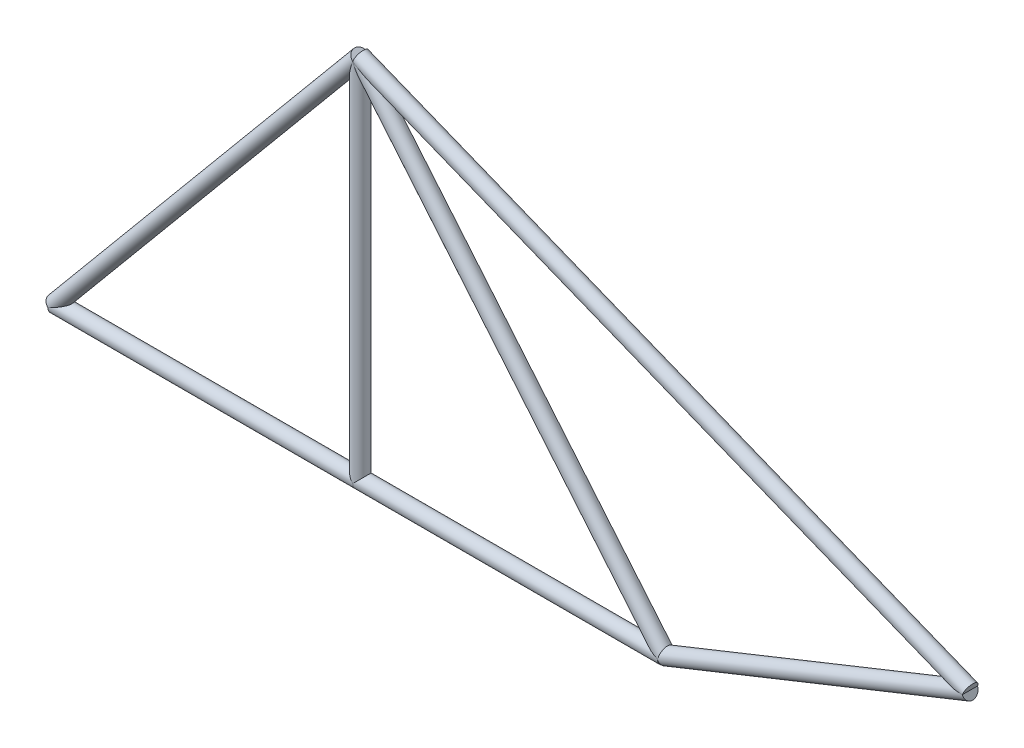
ISO-10303-21;
HEADER;
FILE_DESCRIPTION(('STEP AP214'),'2;1');
FILE_NAME('part.step','',(''),(''),'','','');
FILE_SCHEMA(('AUTOMOTIVE_DESIGN { 1 0 10303 214 1 1 1 1 }'));
ENDSEC;
DATA;
#1=APPLICATION_CONTEXT('core data for automotive mechanical design processes');
#2=APPLICATION_PROTOCOL_DEFINITION('international standard','automotive_design',2000,#1);
#3=PRODUCT_CONTEXT('',#1,'mechanical');
#4=PRODUCT('Part','Part','',(#3));
#5=PRODUCT_RELATED_PRODUCT_CATEGORY('part','',(#4));
#6=PRODUCT_DEFINITION_FORMATION('','',#4);
#7=PRODUCT_DEFINITION_CONTEXT('part definition',#1,'design');
#8=PRODUCT_DEFINITION('design','',#6,#7);
#9=PRODUCT_DEFINITION_SHAPE('','',#8);
#10=(LENGTH_UNIT() NAMED_UNIT(*) SI_UNIT(.MILLI.,.METRE.));
#11=(NAMED_UNIT(*) PLANE_ANGLE_UNIT() SI_UNIT($,.RADIAN.));
#12=(NAMED_UNIT(*) SI_UNIT($,.STERADIAN.) SOLID_ANGLE_UNIT());
#13=UNCERTAINTY_MEASURE_WITH_UNIT(LENGTH_MEASURE(1.E-05),#10,'distance_accuracy_value','');
#14=(GEOMETRIC_REPRESENTATION_CONTEXT(3) GLOBAL_UNCERTAINTY_ASSIGNED_CONTEXT((#13)) GLOBAL_UNIT_ASSIGNED_CONTEXT((#10,
#11,#12)) REPRESENTATION_CONTEXT('',''));
#15=CARTESIAN_POINT('',(0.,0.,0.));
#16=DIRECTION('',(0.,0.,1.));
#17=DIRECTION('',(1.,0.,0.));
#18=AXIS2_PLACEMENT_3D('',#15,#16,#17);
#19=CARTESIAN_POINT('',(5080.,0.,0.));
#20=DIRECTION('',(0.928476690885259,0.371390676354104,0.));
#21=DIRECTION('',(-0.371390676354104,0.928476690885259,0.));
#22=AXIS2_PLACEMENT_3D('',#19,#20,#21);
#23=CYLINDRICAL_SURFACE('',#22,63.5);
#24=CARTESIAN_POINT('',(5080.,0.,0.));
#25=DIRECTION('',(0.969460291496286,-0.245248329682256,0.));
#26=DIRECTION('',(-0.245248329682256,-0.969460291496286,0.));
#27=AXIS2_PLACEMENT_3D('',#24,#25,#26);
#28=ELLIPSE('',#27,78.4882456521442,63.5);
#29=CARTESIAN_POINT('',(5080.,0.,-63.5));
#30=VERTEX_POINT('',#29);
#31=CARTESIAN_POINT('',(5080.,-4.44089209850063E-13,63.5));
#32=VERTEX_POINT('',#31);
#33=EDGE_CURVE('E85',#30,#32,#28,.T.);
#34=ORIENTED_EDGE('',*,*,#33,.T.);
#35=CARTESIAN_POINT('',(5080.,0.,0.));
#36=DIRECTION('',(0.981956386731422,0.189107521154951,0.));
#37=DIRECTION('',(0.189107521154951,-0.981956386731422,0.));
#38=AXIS2_PLACEMENT_3D('',#35,#36,#37);
#39=ELLIPSE('',#38,64.6668231481936,63.5);
#40=EDGE_CURVE('E76',#30,#32,#39,.T.);
#41=ORIENTED_EDGE('',*,*,#40,.F.);
#42=EDGE_LOOP('',(#34,#41));
#43=FACE_BOUND('',#42,.T.);
#44=ADVANCED_FACE('F56',(#43),#23,.F.);
#45=CARTESIAN_POINT('',(2540.,0.,0.));
#46=DIRECTION('',(1.,0.,0.));
#47=DIRECTION('',(0.,0.,-1.));
#48=AXIS2_PLACEMENT_3D('',#45,#46,#47);
#49=CYLINDRICAL_SURFACE('',#48,63.5);
#50=CARTESIAN_POINT('',(5080.,-2.22044604925031E-13,0.));
#51=DIRECTION('',(-0.424155396249723,-0.90558942122368,0.));
#52=DIRECTION('',(0.90558942122368,-0.424155396249724,0.));
#53=AXIS2_PLACEMENT_3D('',#50,#51,#52);
#54=ELLIPSE('',#53,149.709282403221,63.5);
#55=EDGE_CURVE('E88',#32,#30,#54,.T.);
#56=ORIENTED_EDGE('',*,*,#55,.T.);
#57=ORIENTED_EDGE('',*,*,#40,.T.);
#58=EDGE_LOOP('',(#56,#57));
#59=FACE_BOUND('',#58,.T.);
#60=ADVANCED_FACE('F58',(#59),#49,.F.);
#61=CARTESIAN_POINT('',(2540.,3048.,0.));
#62=DIRECTION('',(0.64018439966448,-0.768221279597376,0.));
#63=DIRECTION('',(0.768221279597376,0.64018439966448,0.));
#64=AXIS2_PLACEMENT_3D('',#61,#62,#63);
#65=CYLINDRICAL_SURFACE('',#64,63.5);
#66=ORIENTED_EDGE('',*,*,#55,.F.);
#67=ORIENTED_EDGE('',*,*,#33,.F.);
#68=EDGE_LOOP('',(#66,#67));
#69=FACE_BOUND('',#68,.T.);
#70=CARTESIAN_POINT('',(2539.99999999999,3048.,0.));
#71=DIRECTION('',(-0.58775587094577,-0.809038340357723,0.));
#72=DIRECTION('',(0.809038340357723,-0.58775587094577,0.));
#73=AXIS2_PLACEMENT_3D('',#70,#71,#72);
#74=ELLIPSE('',#73,258.921233356699,63.5);
#75=CARTESIAN_POINT('',(2540.,3048.,63.5));
#76=VERTEX_POINT('',#75);
#77=CARTESIAN_POINT('',(2540.,3048.,-63.5));
#78=VERTEX_POINT('',#77);
#79=EDGE_CURVE('E13',#76,#78,#74,.F.);
#80=ORIENTED_EDGE('',*,*,#79,.F.);
#81=CARTESIAN_POINT('',(2540.,3048.,0.));
#82=DIRECTION('',(1.,0.,0.));
#83=DIRECTION('',(0.,-1.,0.));
#84=AXIS2_PLACEMENT_3D('',#81,#82,#83);
#85=ELLIPSE('',#84,99.1901708840145,63.5);
#86=EDGE_CURVE('E64',#78,#76,#85,.F.);
#87=ORIENTED_EDGE('',*,*,#86,.F.);
#88=EDGE_LOOP('',(#80,#87));
#89=FACE_BOUND('',#88,.T.);
#90=ADVANCED_FACE('F90',(#69,#89),#65,.T.);
#91=CARTESIAN_POINT('',(2540.,3048.,0.));
#92=DIRECTION('',(-0.64018439966448,-0.768221279597376,0.));
#93=DIRECTION('',(0.768221279597376,-0.64018439966448,0.));
#94=AXIS2_PLACEMENT_3D('',#91,#92,#93);
#95=CYLINDRICAL_SURFACE('',#94,63.5);
#96=ORIENTED_EDGE('',*,*,#86,.T.);
#97=CARTESIAN_POINT('',(2540.,3048.,0.));
#98=DIRECTION('',(-0.969460291496286,-0.245248329682256,0.));
#99=DIRECTION('',(-0.245248329682256,0.969460291496286,0.));
#100=AXIS2_PLACEMENT_3D('',#97,#98,#99);
#101=ELLIPSE('',#100,78.4882456521442,63.5);
#102=EDGE_CURVE('E70',#78,#76,#101,.T.);
#103=ORIENTED_EDGE('',*,*,#102,.F.);
#104=EDGE_LOOP('',(#96,#103));
#105=FACE_BOUND('',#104,.T.);
#106=ADVANCED_FACE('F82',(#105),#95,.F.);
#107=CARTESIAN_POINT('',(7620.,1016.,0.));
#108=DIRECTION('',(-0.928476690885259,0.371390676354104,0.));
#109=DIRECTION('',(-0.371390676354104,-0.928476690885259,0.));
#110=AXIS2_PLACEMENT_3D('',#107,#108,#109);
#111=CYLINDRICAL_SURFACE('',#110,63.5);
#112=ORIENTED_EDGE('',*,*,#79,.T.);
#113=ORIENTED_EDGE('',*,*,#102,.T.);
#114=EDGE_LOOP('',(#112,#113));
#115=FACE_BOUND('',#114,.T.);
#116=ADVANCED_FACE('F87',(#115),#111,.F.);
#117=CLOSED_SHELL('',(#44,#60,#90,#106,#116));
#118=MANIFOLD_SOLID_BREP('B2',#117);
#119=CARTESIAN_POINT('',(2540.,0.,0.));
#120=DIRECTION('',(0.,1.,0.));
#121=DIRECTION('',(-1.,0.,0.));
#122=AXIS2_PLACEMENT_3D('',#119,#120,#121);
#123=CYLINDRICAL_SURFACE('',#122,63.5);
#124=CARTESIAN_POINT('',(2540.,0.,0.));
#125=DIRECTION('',(0.707106781186547,0.707106781186548,0.));
#126=DIRECTION('',(-0.707106781186547,0.707106781186547,0.));
#127=AXIS2_PLACEMENT_3D('',#124,#125,#126);
#128=ELLIPSE('',#127,89.8025612106916,63.5);
#129=CARTESIAN_POINT('',(2540.,0.,63.5));
#130=VERTEX_POINT('',#129);
#131=CARTESIAN_POINT('',(2540.,0.,-63.5));
#132=VERTEX_POINT('',#131);
#133=EDGE_CURVE('E203',#130,#132,#128,.F.);
#134=ORIENTED_EDGE('',*,*,#133,.F.);
#135=CARTESIAN_POINT('',(2540.,0.,0.));
#136=DIRECTION('',(-0.707106781186547,0.707106781186547,0.));
#137=DIRECTION('',(0.707106781186547,0.707106781186548,0.));
#138=AXIS2_PLACEMENT_3D('',#135,#136,#137);
#139=ELLIPSE('',#138,89.8025612106916,63.5);
#140=EDGE_CURVE('E205',#132,#130,#139,.F.);
#141=ORIENTED_EDGE('',*,*,#140,.F.);
#142=EDGE_LOOP('',(#134,#141));
#143=FACE_BOUND('',#142,.T.);
#144=CARTESIAN_POINT('',(2540.,3048.,0.));
#145=DIRECTION('',(0.828067230469273,0.560628809305184,0.));
#146=DIRECTION('',(-0.560628809305184,0.828067230469273,0.));
#147=AXIS2_PLACEMENT_3D('',#144,#145,#146);
#148=ELLIPSE('',#147,113.265674089597,63.5);
#149=CARTESIAN_POINT('',(2540.,3048.,63.5));
#150=VERTEX_POINT('',#149);
#151=CARTESIAN_POINT('',(2540.,3048.,-63.5));
#152=VERTEX_POINT('',#151);
#153=EDGE_CURVE('E208',#150,#152,#148,.T.);
#154=ORIENTED_EDGE('',*,*,#153,.F.);
#155=CARTESIAN_POINT('',(2540.,3048.,0.));
#156=DIRECTION('',(-0.940271577683112,0.340425263753018,0.));
#157=DIRECTION('',(0.340425263753018,0.940271577683112,0.));
#158=AXIS2_PLACEMENT_3D('',#155,#156,#157);
#159=ELLIPSE('',#158,186.53139693554,63.5);
#160=EDGE_CURVE('E54',#152,#150,#159,.T.);
#161=ORIENTED_EDGE('',*,*,#160,.F.);
#162=EDGE_LOOP('',(#154,#161));
#163=FACE_BOUND('',#162,.T.);
#164=ADVANCED_FACE('F180',(#143,#163),#123,.T.);
#165=CARTESIAN_POINT('',(1.77635683940025E-12,0.,0.));
#166=DIRECTION('',(1.,0.,0.));
#167=DIRECTION('',(0.,0.,-1.));
#168=AXIS2_PLACEMENT_3D('',#165,#166,#167);
#169=CYLINDRICAL_SURFACE('',#168,63.5);
#170=ORIENTED_EDGE('',*,*,#133,.T.);
#171=ORIENTED_EDGE('',*,*,#140,.T.);
#172=EDGE_LOOP('',(#170,#171));
#173=FACE_BOUND('',#172,.T.);
#174=ADVANCED_FACE('F206',(#173),#169,.F.);
#175=CARTESIAN_POINT('',(7620.,1016.,0.));
#176=DIRECTION('',(-0.928476690885259,0.371390676354104,0.));
#177=DIRECTION('',(-0.371390676354104,-0.928476690885259,0.));
#178=AXIS2_PLACEMENT_3D('',#175,#176,#177);
#179=CYLINDRICAL_SURFACE('',#178,63.5);
#180=ORIENTED_EDGE('',*,*,#153,.T.);
#181=CARTESIAN_POINT('',(2540.,3048.,0.));
#182=DIRECTION('',(-0.969460291496286,-0.245248329682256,0.));
#183=DIRECTION('',(-0.245248329682256,0.969460291496286,0.));
#184=AXIS2_PLACEMENT_3D('',#181,#182,#183);
#185=ELLIPSE('',#184,78.4882456521442,63.5);
#186=EDGE_CURVE('E184',#152,#150,#185,.T.);
#187=ORIENTED_EDGE('',*,*,#186,.T.);
#188=EDGE_LOOP('',(#180,#187));
#189=FACE_BOUND('',#188,.T.);
#190=ADVANCED_FACE('F182',(#189),#179,.F.);
#191=CARTESIAN_POINT('',(2540.,3048.,0.));
#192=DIRECTION('',(-0.64018439966448,-0.768221279597376,0.));
#193=DIRECTION('',(0.768221279597376,-0.64018439966448,0.));
#194=AXIS2_PLACEMENT_3D('',#191,#192,#193);
#195=CYLINDRICAL_SURFACE('',#194,63.5);
#196=ORIENTED_EDGE('',*,*,#160,.T.);
#197=ORIENTED_EDGE('',*,*,#186,.F.);
#198=EDGE_LOOP('',(#196,#197));
#199=FACE_BOUND('',#198,.T.);
#200=ADVANCED_FACE('F215',(#199),#195,.F.);
#201=CLOSED_SHELL('',(#164,#174,#190,#200));
#202=MANIFOLD_SOLID_BREP('B7',#201);
#203=CARTESIAN_POINT('',(1.77635683940025E-12,0.,0.));
#204=DIRECTION('',(1.,0.,0.));
#205=DIRECTION('',(0.,0.,-1.));
#206=AXIS2_PLACEMENT_3D('',#203,#204,#205);
#207=CYLINDRICAL_SURFACE('',#206,63.5);
#208=CARTESIAN_POINT('',(1.77635683940025E-12,0.,0.));
#209=DIRECTION('',(-1.,0.,0.));
#210=DIRECTION('',(0.,-1.,0.));
#211=AXIS2_PLACEMENT_3D('',#208,#209,#210);
#212=CIRCLE('',#211,63.5);
#213=CARTESIAN_POINT('',(1.79045667181299E-12,-63.5,0.));
#214=VERTEX_POINT('',#213);
#215=EDGE_CURVE('E179',#214,#214,#212,.T.);
#216=ORIENTED_EDGE('',*,*,#215,.F.);
#217=EDGE_LOOP('',(#216));
#218=FACE_BOUND('',#217,.T.);
#219=CARTESIAN_POINT('',(2540.,0.,0.));
#220=DIRECTION('',(-1.,0.,0.));
#221=DIRECTION('',(0.,-1.,0.));
#222=AXIS2_PLACEMENT_3D('',#219,#220,#221);
#223=CIRCLE('',#222,63.5);
#224=CARTESIAN_POINT('',(2540.,-63.5,0.));
#225=VERTEX_POINT('',#224);
#226=EDGE_CURVE('E289',#225,#225,#223,.T.);
#227=ORIENTED_EDGE('',*,*,#226,.T.);
#228=EDGE_LOOP('',(#227));
#229=FACE_BOUND('',#228,.T.);
#230=ADVANCED_FACE('F286',(#218,#229),#207,.T.);
#231=CARTESIAN_POINT('',(1.77635683940025E-12,0.,0.));
#232=DIRECTION('',(-1.,0.,0.));
#233=DIRECTION('',(0.,-1.,0.));
#234=AXIS2_PLACEMENT_3D('',#231,#232,#233);
#235=PLANE('',#234);
#236=ORIENTED_EDGE('',*,*,#215,.T.);
#237=EDGE_LOOP('',(#236));
#238=FACE_BOUND('',#237,.T.);
#239=ADVANCED_FACE('F301',(#238),#235,.T.);
#240=CARTESIAN_POINT('',(2540.,0.,0.));
#241=DIRECTION('',(-1.,0.,0.));
#242=DIRECTION('',(0.,-1.,0.));
#243=AXIS2_PLACEMENT_3D('',#240,#241,#242);
#244=PLANE('',#243);
#245=ORIENTED_EDGE('',*,*,#226,.F.);
#246=EDGE_LOOP('',(#245));
#247=FACE_BOUND('',#246,.T.);
#248=ADVANCED_FACE('F299',(#247),#244,.F.);
#249=CLOSED_SHELL('',(#230,#239,#248));
#250=MANIFOLD_SOLID_BREP('B48',#249);
#251=CARTESIAN_POINT('',(2540.,0.,0.));
#252=DIRECTION('',(1.,0.,0.));
#253=DIRECTION('',(0.,0.,-1.));
#254=AXIS2_PLACEMENT_3D('',#251,#252,#253);
#255=CYLINDRICAL_SURFACE('',#254,63.5);
#256=CARTESIAN_POINT('',(2540.,0.,0.));
#257=DIRECTION('',(-1.,0.,0.));
#258=DIRECTION('',(0.,-1.,0.));
#259=AXIS2_PLACEMENT_3D('',#256,#257,#258);
#260=CIRCLE('',#259,63.5);
#261=CARTESIAN_POINT('',(2540.,-63.5,0.));
#262=VERTEX_POINT('',#261);
#263=EDGE_CURVE('E285',#262,#262,#260,.T.);
#264=ORIENTED_EDGE('',*,*,#263,.F.);
#265=EDGE_LOOP('',(#264));
#266=FACE_BOUND('',#265,.T.);
#267=CARTESIAN_POINT('',(5080.,0.,0.));
#268=DIRECTION('',(-1.,0.,0.));
#269=DIRECTION('',(0.,-1.,0.));
#270=AXIS2_PLACEMENT_3D('',#267,#268,#269);
#271=CIRCLE('',#270,63.5);
#272=CARTESIAN_POINT('',(5080.,-63.5,0.));
#273=VERTEX_POINT('',#272);
#274=EDGE_CURVE('E343',#273,#273,#271,.T.);
#275=ORIENTED_EDGE('',*,*,#274,.T.);
#276=EDGE_LOOP('',(#275));
#277=FACE_BOUND('',#276,.T.);
#278=ADVANCED_FACE('F340',(#266,#277),#255,.T.);
#279=CARTESIAN_POINT('',(2540.,0.,0.));
#280=DIRECTION('',(-1.,0.,0.));
#281=DIRECTION('',(0.,-1.,0.));
#282=AXIS2_PLACEMENT_3D('',#279,#280,#281);
#283=PLANE('',#282);
#284=ORIENTED_EDGE('',*,*,#263,.T.);
#285=EDGE_LOOP('',(#284));
#286=FACE_BOUND('',#285,.T.);
#287=ADVANCED_FACE('F355',(#286),#283,.T.);
#288=CARTESIAN_POINT('',(5080.,0.,0.));
#289=DIRECTION('',(-1.,0.,0.));
#290=DIRECTION('',(0.,-1.,0.));
#291=AXIS2_PLACEMENT_3D('',#288,#289,#290);
#292=PLANE('',#291);
#293=ORIENTED_EDGE('',*,*,#274,.F.);
#294=EDGE_LOOP('',(#293));
#295=FACE_BOUND('',#294,.T.);
#296=ADVANCED_FACE('F353',(#295),#292,.F.);
#297=CLOSED_SHELL('',(#278,#287,#296));
#298=MANIFOLD_SOLID_BREP('B174',#297);
#299=CARTESIAN_POINT('',(5080.,0.,0.));
#300=DIRECTION('',(0.928476690885259,0.371390676354104,0.));
#301=DIRECTION('',(-0.371390676354104,0.928476690885259,0.));
#302=AXIS2_PLACEMENT_3D('',#299,#300,#301);
#303=CYLINDRICAL_SURFACE('',#302,63.5);
#304=CARTESIAN_POINT('',(5080.,0.,0.));
#305=DIRECTION('',(-0.928476690885259,-0.371390676354104,0.));
#306=DIRECTION('',(0.371390676354104,-0.928476690885259,0.));
#307=AXIS2_PLACEMENT_3D('',#304,#305,#306);
#308=CIRCLE('',#307,63.5);
#309=CARTESIAN_POINT('',(5103.58330794849,-58.958269871214,0.));
#310=VERTEX_POINT('',#309);
#311=EDGE_CURVE('E339',#310,#310,#308,.T.);
#312=ORIENTED_EDGE('',*,*,#311,.F.);
#313=EDGE_LOOP('',(#312));
#314=FACE_BOUND('',#313,.T.);
#315=CARTESIAN_POINT('',(7620.,1016.,0.));
#316=DIRECTION('',(-0.928476690885259,-0.371390676354104,0.));
#317=DIRECTION('',(0.371390676354104,-0.928476690885259,0.));
#318=AXIS2_PLACEMENT_3D('',#315,#316,#317);
#319=CIRCLE('',#318,63.5);
#320=CARTESIAN_POINT('',(7643.58330794849,957.041730128786,0.));
#321=VERTEX_POINT('',#320);
#322=EDGE_CURVE('E397',#321,#321,#319,.T.);
#323=ORIENTED_EDGE('',*,*,#322,.T.);
#324=EDGE_LOOP('',(#323));
#325=FACE_BOUND('',#324,.T.);
#326=ADVANCED_FACE('F394',(#314,#325),#303,.T.);
#327=CARTESIAN_POINT('',(5080.,0.,0.));
#328=DIRECTION('',(-0.928476690885259,-0.371390676354104,0.));
#329=DIRECTION('',(0.371390676354104,-0.928476690885259,0.));
#330=AXIS2_PLACEMENT_3D('',#327,#328,#329);
#331=PLANE('',#330);
#332=ORIENTED_EDGE('',*,*,#311,.T.);
#333=EDGE_LOOP('',(#332));
#334=FACE_BOUND('',#333,.T.);
#335=ADVANCED_FACE('F409',(#334),#331,.T.);
#336=CARTESIAN_POINT('',(7620.,1016.,0.));
#337=DIRECTION('',(-0.928476690885259,-0.371390676354104,0.));
#338=DIRECTION('',(0.371390676354104,-0.928476690885259,0.));
#339=AXIS2_PLACEMENT_3D('',#336,#337,#338);
#340=PLANE('',#339);
#341=ORIENTED_EDGE('',*,*,#322,.F.);
#342=EDGE_LOOP('',(#341));
#343=FACE_BOUND('',#342,.T.);
#344=ADVANCED_FACE('F407',(#343),#340,.F.);
#345=CLOSED_SHELL('',(#326,#335,#344));
#346=MANIFOLD_SOLID_BREP('B280',#345);
#347=CARTESIAN_POINT('',(7620.,1016.,0.));
#348=DIRECTION('',(-0.928476690885259,0.371390676354104,0.));
#349=DIRECTION('',(-0.371390676354104,-0.928476690885259,0.));
#350=AXIS2_PLACEMENT_3D('',#347,#348,#349);
#351=CYLINDRICAL_SURFACE('',#350,63.5);
#352=CARTESIAN_POINT('',(7620.,1016.,0.));
#353=DIRECTION('',(0.92847669088526,-0.371390676354104,0.));
#354=DIRECTION('',(0.371390676354104,0.92847669088526,0.));
#355=AXIS2_PLACEMENT_3D('',#352,#353,#354);
#356=CIRCLE('',#355,63.5);
#357=CARTESIAN_POINT('',(7643.58330794848,1074.95826987121,0.));
#358=VERTEX_POINT('',#357);
#359=EDGE_CURVE('E393',#358,#358,#356,.T.);
#360=ORIENTED_EDGE('',*,*,#359,.F.);
#361=EDGE_LOOP('',(#360));
#362=FACE_BOUND('',#361,.T.);
#363=CARTESIAN_POINT('',(2540.,3048.,0.));
#364=DIRECTION('',(0.92847669088526,-0.371390676354104,0.));
#365=DIRECTION('',(0.371390676354104,0.92847669088526,0.));
#366=AXIS2_PLACEMENT_3D('',#363,#364,#365);
#367=CIRCLE('',#366,63.5);
#368=CARTESIAN_POINT('',(2563.58330794849,3106.95826987121,0.));
#369=VERTEX_POINT('',#368);
#370=EDGE_CURVE('E450',#369,#369,#367,.T.);
#371=ORIENTED_EDGE('',*,*,#370,.T.);
#372=EDGE_LOOP('',(#371));
#373=FACE_BOUND('',#372,.T.);
#374=ADVANCED_FACE('F447',(#362,#373),#351,.T.);
#375=CARTESIAN_POINT('',(7620.,1016.,0.));
#376=DIRECTION('',(0.92847669088526,-0.371390676354104,0.));
#377=DIRECTION('',(0.371390676354104,0.92847669088526,0.));
#378=AXIS2_PLACEMENT_3D('',#375,#376,#377);
#379=PLANE('',#378);
#380=ORIENTED_EDGE('',*,*,#359,.T.);
#381=EDGE_LOOP('',(#380));
#382=FACE_BOUND('',#381,.T.);
#383=ADVANCED_FACE('F462',(#382),#379,.T.);
#384=CARTESIAN_POINT('',(2540.,3048.,0.));
#385=DIRECTION('',(0.92847669088526,-0.371390676354104,0.));
#386=DIRECTION('',(0.371390676354104,0.92847669088526,0.));
#387=AXIS2_PLACEMENT_3D('',#384,#385,#386);
#388=PLANE('',#387);
#389=ORIENTED_EDGE('',*,*,#370,.F.);
#390=EDGE_LOOP('',(#389));
#391=FACE_BOUND('',#390,.T.);
#392=ADVANCED_FACE('F460',(#391),#388,.F.);
#393=CLOSED_SHELL('',(#374,#383,#392));
#394=MANIFOLD_SOLID_BREP('B334',#393);
#395=CARTESIAN_POINT('',(2540.,3048.,0.));
#396=DIRECTION('',(-0.64018439966448,-0.768221279597376,0.));
#397=DIRECTION('',(0.768221279597376,-0.64018439966448,0.));
#398=AXIS2_PLACEMENT_3D('',#395,#396,#397);
#399=CYLINDRICAL_SURFACE('',#398,63.5);
#400=CARTESIAN_POINT('',(2540.,3048.,0.));
#401=DIRECTION('',(0.64018439966448,0.768221279597376,0.));
#402=DIRECTION('',(-0.768221279597376,0.64018439966448,0.));
#403=AXIS2_PLACEMENT_3D('',#400,#401,#402);
#404=CIRCLE('',#403,63.5);
#405=CARTESIAN_POINT('',(2491.21794874557,3088.65170937869,0.));
#406=VERTEX_POINT('',#405);
#407=EDGE_CURVE('E446',#406,#406,#404,.T.);
#408=ORIENTED_EDGE('',*,*,#407,.F.);
#409=EDGE_LOOP('',(#408));
#410=FACE_BOUND('',#409,.T.);
#411=CARTESIAN_POINT('',(0.,0.,0.));
#412=DIRECTION('',(0.64018439966448,0.768221279597376,0.));
#413=DIRECTION('',(-0.768221279597376,0.64018439966448,0.));
#414=AXIS2_PLACEMENT_3D('',#411,#412,#413);
#415=CIRCLE('',#414,63.5);
#416=CARTESIAN_POINT('',(-48.7820512544334,40.6517093786945,0.));
#417=VERTEX_POINT('',#416);
#418=EDGE_CURVE('E496',#417,#417,#415,.T.);
#419=ORIENTED_EDGE('',*,*,#418,.T.);
#420=EDGE_LOOP('',(#419));
#421=FACE_BOUND('',#420,.T.);
#422=ADVANCED_FACE('F493',(#410,#421),#399,.T.);
#423=CARTESIAN_POINT('',(2540.,3048.,0.));
#424=DIRECTION('',(0.64018439966448,0.768221279597376,0.));
#425=DIRECTION('',(-0.768221279597376,0.64018439966448,0.));
#426=AXIS2_PLACEMENT_3D('',#423,#424,#425);
#427=PLANE('',#426);
#428=ORIENTED_EDGE('',*,*,#407,.T.);
#429=EDGE_LOOP('',(#428));
#430=FACE_BOUND('',#429,.T.);
#431=ADVANCED_FACE('F508',(#430),#427,.T.);
#432=CARTESIAN_POINT('',(0.,0.,0.));
#433=DIRECTION('',(0.64018439966448,0.768221279597376,0.));
#434=DIRECTION('',(-0.768221279597376,0.64018439966448,0.));
#435=AXIS2_PLACEMENT_3D('',#432,#433,#434);
#436=PLANE('',#435);
#437=ORIENTED_EDGE('',*,*,#418,.F.);
#438=EDGE_LOOP('',(#437));
#439=FACE_BOUND('',#438,.T.);
#440=ADVANCED_FACE('F506',(#439),#436,.F.);
#441=CLOSED_SHELL('',(#422,#431,#440));
#442=MANIFOLD_SOLID_BREP('B388',#441);
#443=ADVANCED_BREP_SHAPE_REPRESENTATION('',(#18,#118,#202,#250,#298,#346,#394,#442),#14);
#444=SHAPE_DEFINITION_REPRESENTATION(#9,#443);
ENDSEC;
END-ISO-10303-21;
